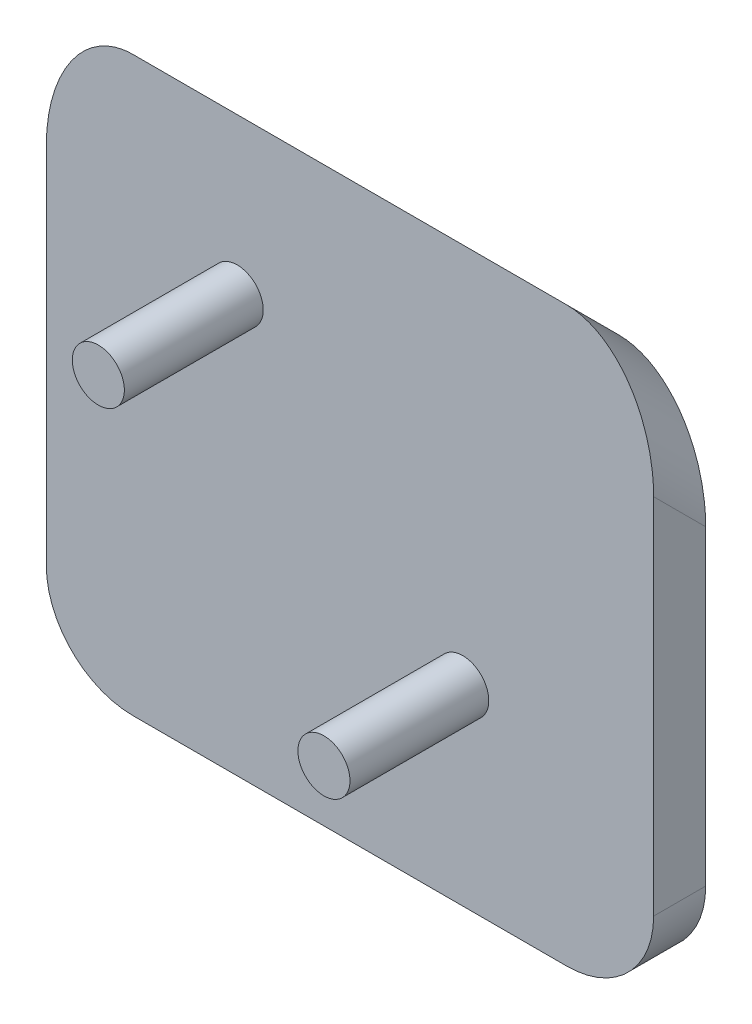
ISO-10303-21;
HEADER;
FILE_DESCRIPTION(('STEP AP214'),'2;1');
FILE_NAME('part.step','',(''),(''),'','','');
FILE_SCHEMA(('AUTOMOTIVE_DESIGN { 1 0 10303 214 1 1 1 1 }'));
ENDSEC;
DATA;
#1=APPLICATION_CONTEXT('core data for automotive mechanical design processes');
#2=APPLICATION_PROTOCOL_DEFINITION('international standard','automotive_design',2000,#1);
#3=PRODUCT_CONTEXT('',#1,'mechanical');
#4=PRODUCT('Part','Part','',(#3));
#5=PRODUCT_RELATED_PRODUCT_CATEGORY('part','',(#4));
#6=PRODUCT_DEFINITION_FORMATION('','',#4);
#7=PRODUCT_DEFINITION_CONTEXT('part definition',#1,'design');
#8=PRODUCT_DEFINITION('design','',#6,#7);
#9=PRODUCT_DEFINITION_SHAPE('','',#8);
#10=(LENGTH_UNIT() NAMED_UNIT(*) SI_UNIT(.MILLI.,.METRE.));
#11=(NAMED_UNIT(*) PLANE_ANGLE_UNIT() SI_UNIT($,.RADIAN.));
#12=(NAMED_UNIT(*) SI_UNIT($,.STERADIAN.) SOLID_ANGLE_UNIT());
#13=UNCERTAINTY_MEASURE_WITH_UNIT(LENGTH_MEASURE(1.E-05),#10,'distance_accuracy_value','');
#14=(GEOMETRIC_REPRESENTATION_CONTEXT(3) GLOBAL_UNCERTAINTY_ASSIGNED_CONTEXT((#13)) GLOBAL_UNIT_ASSIGNED_CONTEXT((#10,
#11,#12)) REPRESENTATION_CONTEXT('',''));
#15=CARTESIAN_POINT('',(0.,0.,0.));
#16=DIRECTION('',(0.,0.,1.));
#17=DIRECTION('',(1.,0.,0.));
#18=AXIS2_PLACEMENT_3D('',#15,#16,#17);
#19=CARTESIAN_POINT('',(0.,0.,3.));
#20=DIRECTION('',(1.,0.,0.));
#21=DIRECTION('',(0.,1.,0.));
#22=AXIS2_PLACEMENT_3D('',#19,#20,#21);
#23=PLANE('',#22);
#24=DIRECTION('',(0.,-1.,0.));
#25=VECTOR('',#24,1.);
#26=CARTESIAN_POINT('',(0.,0.,0.));
#27=LINE('',#26,#25);
#28=CARTESIAN_POINT('',(0.,22.9289321881345,0.));
#29=VERTEX_POINT('',#28);
#30=CARTESIAN_POINT('',(0.,5.,0.));
#31=VERTEX_POINT('',#30);
#32=EDGE_CURVE('E130',#29,#31,#27,.T.);
#33=ORIENTED_EDGE('',*,*,#32,.T.);
#34=DIRECTION('',(0.,0.,-1.));
#35=VECTOR('',#34,1.);
#36=CARTESIAN_POINT('',(0.,5.,3.));
#37=LINE('',#36,#35);
#38=CARTESIAN_POINT('',(0.,5.,3.));
#39=VERTEX_POINT('',#38);
#40=EDGE_CURVE('E108',#31,#39,#37,.F.);
#41=ORIENTED_EDGE('',*,*,#40,.T.);
#42=DIRECTION('',(0.,-1.,0.));
#43=VECTOR('',#42,1.);
#44=CARTESIAN_POINT('',(0.,0.,3.));
#45=LINE('',#44,#43);
#46=CARTESIAN_POINT('',(0.,25.9289321881345,3.));
#47=VERTEX_POINT('',#46);
#48=EDGE_CURVE('E133',#47,#39,#45,.T.);
#49=ORIENTED_EDGE('',*,*,#48,.F.);
#50=DIRECTION('',(0.,-0.707106781186544,-0.707106781186551));
#51=VECTOR('',#50,1.);
#52=CARTESIAN_POINT('',(0.,26.4644660940672,3.53553390593272));
#53=LINE('',#52,#51);
#54=EDGE_CURVE('E113',#47,#29,#53,.T.);
#55=ORIENTED_EDGE('',*,*,#54,.T.);
#56=EDGE_LOOP('',(#33,#41,#49,#55));
#57=FACE_BOUND('',#56,.T.);
#58=ADVANCED_FACE('F39',(#57),#23,.F.);
#59=CARTESIAN_POINT('',(0.,0.,3.));
#60=DIRECTION('',(0.,1.,0.));
#61=DIRECTION('',(0.,0.,1.));
#62=AXIS2_PLACEMENT_3D('',#59,#60,#61);
#63=PLANE('',#62);
#64=DIRECTION('',(1.,0.,0.));
#65=VECTOR('',#64,1.);
#66=CARTESIAN_POINT('',(0.,0.,3.));
#67=LINE('',#66,#65);
#68=CARTESIAN_POINT('',(5.,0.,3.));
#69=VERTEX_POINT('',#68);
#70=CARTESIAN_POINT('',(30.,0.,3.));
#71=VERTEX_POINT('',#70);
#72=EDGE_CURVE('E123',#69,#71,#67,.T.);
#73=ORIENTED_EDGE('',*,*,#72,.F.);
#74=DIRECTION('',(0.,0.,-1.));
#75=VECTOR('',#74,1.);
#76=CARTESIAN_POINT('',(5.,0.,3.));
#77=LINE('',#76,#75);
#78=CARTESIAN_POINT('',(5.,0.,0.));
#79=VERTEX_POINT('',#78);
#80=EDGE_CURVE('E107',#69,#79,#77,.T.);
#81=ORIENTED_EDGE('',*,*,#80,.T.);
#82=DIRECTION('',(1.,0.,0.));
#83=VECTOR('',#82,1.);
#84=CARTESIAN_POINT('',(0.,0.,0.));
#85=LINE('',#84,#83);
#86=CARTESIAN_POINT('',(30.,0.,0.));
#87=VERTEX_POINT('',#86);
#88=EDGE_CURVE('E120',#79,#87,#85,.T.);
#89=ORIENTED_EDGE('',*,*,#88,.T.);
#90=DIRECTION('',(0.,0.,-1.));
#91=VECTOR('',#90,1.);
#92=CARTESIAN_POINT('',(30.,0.,3.));
#93=LINE('',#92,#91);
#94=EDGE_CURVE('E125',#87,#71,#93,.F.);
#95=ORIENTED_EDGE('',*,*,#94,.T.);
#96=EDGE_LOOP('',(#73,#81,#89,#95));
#97=FACE_BOUND('',#96,.T.);
#98=ADVANCED_FACE('F119',(#97),#63,.F.);
#99=CARTESIAN_POINT('',(35.,0.,3.));
#100=DIRECTION('',(-1.,0.,0.));
#101=DIRECTION('',(0.,-1.,0.));
#102=AXIS2_PLACEMENT_3D('',#99,#100,#101);
#103=PLANE('',#102);
#104=DIRECTION('',(0.,1.,0.));
#105=VECTOR('',#104,1.);
#106=CARTESIAN_POINT('',(35.,0.,3.));
#107=LINE('',#106,#105);
#108=CARTESIAN_POINT('',(35.,5.,3.));
#109=VERTEX_POINT('',#108);
#110=CARTESIAN_POINT('',(35.,25.9289321881345,3.));
#111=VERTEX_POINT('',#110);
#112=EDGE_CURVE('E143',#109,#111,#107,.T.);
#113=ORIENTED_EDGE('',*,*,#112,.F.);
#114=DIRECTION('',(0.,0.,-1.));
#115=VECTOR('',#114,1.);
#116=CARTESIAN_POINT('',(35.,5.,3.));
#117=LINE('',#116,#115);
#118=CARTESIAN_POINT('',(35.,5.,0.));
#119=VERTEX_POINT('',#118);
#120=EDGE_CURVE('E169',#109,#119,#117,.T.);
#121=ORIENTED_EDGE('',*,*,#120,.T.);
#122=DIRECTION('',(0.,1.,0.));
#123=VECTOR('',#122,1.);
#124=CARTESIAN_POINT('',(35.,0.,0.));
#125=LINE('',#124,#123);
#126=CARTESIAN_POINT('',(35.,22.9289321881345,0.));
#127=VERTEX_POINT('',#126);
#128=EDGE_CURVE('E129',#119,#127,#125,.T.);
#129=ORIENTED_EDGE('',*,*,#128,.T.);
#130=DIRECTION('',(0.,0.707106781186544,0.707106781186551));
#131=VECTOR('',#130,1.);
#132=CARTESIAN_POINT('',(35.,29.4644660940672,6.53553390593272));
#133=LINE('',#132,#131);
#134=EDGE_CURVE('E166',#127,#111,#133,.T.);
#135=ORIENTED_EDGE('',*,*,#134,.T.);
#136=EDGE_LOOP('',(#113,#121,#129,#135));
#137=FACE_BOUND('',#136,.T.);
#138=ADVANCED_FACE('F174',(#137),#103,.F.);
#139=CARTESIAN_POINT('',(0.,0.,3.));
#140=DIRECTION('',(0.,0.,-1.));
#141=DIRECTION('',(-1.,0.,0.));
#142=AXIS2_PLACEMENT_3D('',#139,#140,#141);
#143=PLANE('',#142);
#144=CARTESIAN_POINT('',(24.,11.,3.));
#145=DIRECTION('',(0.,0.,-1.));
#146=DIRECTION('',(-1.,0.,0.));
#147=AXIS2_PLACEMENT_3D('',#144,#145,#146);
#148=CIRCLE('',#147,1.5);
#149=CARTESIAN_POINT('',(22.5,11.,3.));
#150=VERTEX_POINT('',#149);
#151=EDGE_CURVE('E142',#150,#150,#148,.F.);
#152=ORIENTED_EDGE('',*,*,#151,.F.);
#153=EDGE_LOOP('',(#152));
#154=FACE_BOUND('',#153,.T.);
#155=CARTESIAN_POINT('',(11.,24.,3.));
#156=DIRECTION('',(0.,0.,-1.));
#157=DIRECTION('',(-1.,0.,0.));
#158=AXIS2_PLACEMENT_3D('',#155,#156,#157);
#159=CIRCLE('',#158,1.5);
#160=CARTESIAN_POINT('',(9.49999999999998,24.,3.));
#161=VERTEX_POINT('',#160);
#162=EDGE_CURVE('E139',#161,#161,#159,.F.);
#163=ORIENTED_EDGE('',*,*,#162,.F.);
#164=EDGE_LOOP('',(#163));
#165=FACE_BOUND('',#164,.T.);
#166=ORIENTED_EDGE('',*,*,#48,.T.);
#167=CARTESIAN_POINT('',(5.,5.,3.));
#168=DIRECTION('',(0.,0.,-1.));
#169=DIRECTION('',(-1.,0.,0.));
#170=AXIS2_PLACEMENT_3D('',#167,#168,#169);
#171=CIRCLE('',#170,5.);
#172=EDGE_CURVE('E164',#39,#69,#171,.F.);
#173=ORIENTED_EDGE('',*,*,#172,.T.);
#174=ORIENTED_EDGE('',*,*,#72,.T.);
#175=CARTESIAN_POINT('',(30.,5.,3.));
#176=DIRECTION('',(0.,0.,-1.));
#177=DIRECTION('',(-1.,0.,0.));
#178=AXIS2_PLACEMENT_3D('',#175,#176,#177);
#179=CIRCLE('',#178,5.);
#180=EDGE_CURVE('E162',#71,#109,#179,.F.);
#181=ORIENTED_EDGE('',*,*,#180,.T.);
#182=ORIENTED_EDGE('',*,*,#112,.T.);
#183=CARTESIAN_POINT('',(30.,25.9289321881345,3.));
#184=DIRECTION('',(0.,0.,-1.));
#185=DIRECTION('',(0.,-1.,0.));
#186=AXIS2_PLACEMENT_3D('',#183,#184,#185);
#187=ELLIPSE('',#186,7.07106781186544,5.);
#188=CARTESIAN_POINT('',(30.,32.9999999999999,3.));
#189=VERTEX_POINT('',#188);
#190=EDGE_CURVE('E60',#111,#189,#187,.F.);
#191=ORIENTED_EDGE('',*,*,#190,.T.);
#192=DIRECTION('',(-1.,0.,0.));
#193=VECTOR('',#192,1.);
#194=CARTESIAN_POINT('',(0.,32.9999999999999,3.));
#195=LINE('',#194,#193);
#196=CARTESIAN_POINT('',(4.99999999999999,32.9999999999999,3.));
#197=VERTEX_POINT('',#196);
#198=EDGE_CURVE('E146',#189,#197,#195,.T.);
#199=ORIENTED_EDGE('',*,*,#198,.T.);
#200=CARTESIAN_POINT('',(4.99999999999999,25.9289321881345,3.));
#201=DIRECTION('',(0.,0.,-1.));
#202=DIRECTION('',(0.,1.,0.));
#203=AXIS2_PLACEMENT_3D('',#200,#201,#202);
#204=ELLIPSE('',#203,7.07106781186544,5.);
#205=EDGE_CURVE('E159',#197,#47,#204,.F.);
#206=ORIENTED_EDGE('',*,*,#205,.T.);
#207=EDGE_LOOP('',(#166,#173,#174,#181,#182,#191,#199,#206));
#208=FACE_BOUND('',#207,.T.);
#209=ADVANCED_FACE('F183',(#154,#165,#208),#143,.F.);
#210=CARTESIAN_POINT('',(0.,0.,0.));
#211=DIRECTION('',(0.,0.,-1.));
#212=DIRECTION('',(-1.,0.,0.));
#213=AXIS2_PLACEMENT_3D('',#210,#211,#212);
#214=PLANE('',#213);
#215=ORIENTED_EDGE('',*,*,#88,.F.);
#216=CARTESIAN_POINT('',(5.,5.,0.));
#217=DIRECTION('',(0.,0.,-1.));
#218=DIRECTION('',(-1.,0.,0.));
#219=AXIS2_PLACEMENT_3D('',#216,#217,#218);
#220=CIRCLE('',#219,5.);
#221=EDGE_CURVE('E103',#79,#31,#220,.T.);
#222=ORIENTED_EDGE('',*,*,#221,.T.);
#223=ORIENTED_EDGE('',*,*,#32,.F.);
#224=CARTESIAN_POINT('',(4.99999999999999,22.9289321881345,0.));
#225=DIRECTION('',(0.,0.,-1.));
#226=DIRECTION('',(0.,1.,0.));
#227=AXIS2_PLACEMENT_3D('',#224,#225,#226);
#228=ELLIPSE('',#227,7.07106781186544,5.);
#229=CARTESIAN_POINT('',(4.99999999999999,30.,0.));
#230=VERTEX_POINT('',#229);
#231=EDGE_CURVE('E124',#29,#230,#228,.T.);
#232=ORIENTED_EDGE('',*,*,#231,.T.);
#233=DIRECTION('',(1.,0.,0.));
#234=VECTOR('',#233,1.);
#235=CARTESIAN_POINT('',(35.,30.,0.));
#236=LINE('',#235,#234);
#237=CARTESIAN_POINT('',(30.,30.,0.));
#238=VERTEX_POINT('',#237);
#239=EDGE_CURVE('E148',#230,#238,#236,.T.);
#240=ORIENTED_EDGE('',*,*,#239,.T.);
#241=CARTESIAN_POINT('',(30.,22.9289321881345,0.));
#242=DIRECTION('',(0.,0.,-1.));
#243=DIRECTION('',(0.,-1.,0.));
#244=AXIS2_PLACEMENT_3D('',#241,#242,#243);
#245=ELLIPSE('',#244,7.07106781186544,5.);
#246=EDGE_CURVE('E153',#238,#127,#245,.T.);
#247=ORIENTED_EDGE('',*,*,#246,.T.);
#248=ORIENTED_EDGE('',*,*,#128,.F.);
#249=CARTESIAN_POINT('',(30.,5.,0.));
#250=DIRECTION('',(0.,0.,-1.));
#251=DIRECTION('',(-1.,0.,0.));
#252=AXIS2_PLACEMENT_3D('',#249,#250,#251);
#253=CIRCLE('',#252,5.);
#254=EDGE_CURVE('E114',#119,#87,#253,.T.);
#255=ORIENTED_EDGE('',*,*,#254,.T.);
#256=EDGE_LOOP('',(#215,#222,#223,#232,#240,#247,#248,#255));
#257=FACE_BOUND('',#256,.T.);
#258=ADVANCED_FACE('F127',(#257),#214,.T.);
#259=CARTESIAN_POINT('',(11.,24.,11.));
#260=DIRECTION('',(0.,0.,-1.));
#261=DIRECTION('',(-1.,0.,0.));
#262=AXIS2_PLACEMENT_3D('',#259,#260,#261);
#263=CYLINDRICAL_SURFACE('',#262,1.5);
#264=CARTESIAN_POINT('',(11.,24.,11.));
#265=DIRECTION('',(0.,0.,1.));
#266=DIRECTION('',(1.,0.,0.));
#267=AXIS2_PLACEMENT_3D('',#264,#265,#266);
#268=CIRCLE('',#267,1.5);
#269=CARTESIAN_POINT('',(12.5,24.,11.));
#270=VERTEX_POINT('',#269);
#271=EDGE_CURVE('E135',#270,#270,#268,.T.);
#272=ORIENTED_EDGE('',*,*,#271,.F.);
#273=EDGE_LOOP('',(#272));
#274=FACE_BOUND('',#273,.T.);
#275=ORIENTED_EDGE('',*,*,#162,.T.);
#276=EDGE_LOOP('',(#275));
#277=FACE_BOUND('',#276,.T.);
#278=ADVANCED_FACE('F207',(#274,#277),#263,.T.);
#279=CARTESIAN_POINT('',(11.,24.,11.));
#280=DIRECTION('',(0.,0.,1.));
#281=DIRECTION('',(1.,0.,0.));
#282=AXIS2_PLACEMENT_3D('',#279,#280,#281);
#283=PLANE('',#282);
#284=ORIENTED_EDGE('',*,*,#271,.T.);
#285=EDGE_LOOP('',(#284));
#286=FACE_BOUND('',#285,.T.);
#287=ADVANCED_FACE('F198',(#286),#283,.T.);
#288=CARTESIAN_POINT('',(24.,11.,11.));
#289=DIRECTION('',(0.,0.,-1.));
#290=DIRECTION('',(-1.,0.,0.));
#291=AXIS2_PLACEMENT_3D('',#288,#289,#290);
#292=CYLINDRICAL_SURFACE('',#291,1.5);
#293=CARTESIAN_POINT('',(24.,11.,11.));
#294=DIRECTION('',(0.,0.,1.));
#295=DIRECTION('',(1.,0.,0.));
#296=AXIS2_PLACEMENT_3D('',#293,#294,#295);
#297=CIRCLE('',#296,1.5);
#298=CARTESIAN_POINT('',(25.5,11.,11.));
#299=VERTEX_POINT('',#298);
#300=EDGE_CURVE('E189',#299,#299,#297,.T.);
#301=ORIENTED_EDGE('',*,*,#300,.F.);
#302=EDGE_LOOP('',(#301));
#303=FACE_BOUND('',#302,.T.);
#304=ORIENTED_EDGE('',*,*,#151,.T.);
#305=EDGE_LOOP('',(#304));
#306=FACE_BOUND('',#305,.T.);
#307=ADVANCED_FACE('F195',(#303,#306),#292,.T.);
#308=CARTESIAN_POINT('',(24.,11.,11.));
#309=DIRECTION('',(0.,0.,1.));
#310=DIRECTION('',(1.,0.,0.));
#311=AXIS2_PLACEMENT_3D('',#308,#309,#310);
#312=PLANE('',#311);
#313=ORIENTED_EDGE('',*,*,#300,.T.);
#314=EDGE_LOOP('',(#313));
#315=FACE_BOUND('',#314,.T.);
#316=ADVANCED_FACE('F193',(#315),#312,.T.);
#317=CARTESIAN_POINT('',(0.,35.,5.00000000000009));
#318=DIRECTION('',(0.,0.707106781186551,-0.707106781186544));
#319=DIRECTION('',(1.,0.,0.));
#320=AXIS2_PLACEMENT_3D('',#317,#318,#319);
#321=PLANE('',#320);
#322=ORIENTED_EDGE('',*,*,#198,.F.);
#323=DIRECTION('',(0.,0.707106781186544,0.707106781186551));
#324=VECTOR('',#323,1.);
#325=CARTESIAN_POINT('',(30.,30.,0.));
#326=LINE('',#325,#324);
#327=EDGE_CURVE('E11',#189,#238,#326,.F.);
#328=ORIENTED_EDGE('',*,*,#327,.T.);
#329=ORIENTED_EDGE('',*,*,#239,.F.);
#330=DIRECTION('',(0.,-0.707106781186544,-0.707106781186551));
#331=VECTOR('',#330,1.);
#332=CARTESIAN_POINT('',(4.99999999999999,32.9999999999999,3.));
#333=LINE('',#332,#331);
#334=EDGE_CURVE('E47',#230,#197,#333,.F.);
#335=ORIENTED_EDGE('',*,*,#334,.T.);
#336=EDGE_LOOP('',(#322,#328,#329,#335));
#337=FACE_BOUND('',#336,.T.);
#338=ADVANCED_FACE('F229',(#337),#321,.T.);
#339=CARTESIAN_POINT('',(5.,5.,3.));
#340=DIRECTION('',(0.,0.,-1.));
#341=DIRECTION('',(-1.,0.,0.));
#342=AXIS2_PLACEMENT_3D('',#339,#340,#341);
#343=CYLINDRICAL_SURFACE('',#342,5.);
#344=ORIENTED_EDGE('',*,*,#172,.F.);
#345=ORIENTED_EDGE('',*,*,#40,.F.);
#346=ORIENTED_EDGE('',*,*,#221,.F.);
#347=ORIENTED_EDGE('',*,*,#80,.F.);
#348=EDGE_LOOP('',(#344,#345,#346,#347));
#349=FACE_BOUND('',#348,.T.);
#350=ADVANCED_FACE('F106',(#349),#343,.T.);
#351=CARTESIAN_POINT('',(30.,5.,3.));
#352=DIRECTION('',(0.,0.,-1.));
#353=DIRECTION('',(-1.,0.,0.));
#354=AXIS2_PLACEMENT_3D('',#351,#352,#353);
#355=CYLINDRICAL_SURFACE('',#354,5.);
#356=ORIENTED_EDGE('',*,*,#180,.F.);
#357=ORIENTED_EDGE('',*,*,#94,.F.);
#358=ORIENTED_EDGE('',*,*,#254,.F.);
#359=ORIENTED_EDGE('',*,*,#120,.F.);
#360=EDGE_LOOP('',(#356,#357,#358,#359));
#361=FACE_BOUND('',#360,.T.);
#362=ADVANCED_FACE('F236',(#361),#355,.T.);
#363=CARTESIAN_POINT('',(30.,12.9644660940674,-9.96446609406725));
#364=DIRECTION('',(0.,-0.707106781186544,-0.707106781186551));
#365=DIRECTION('',(0.,0.707106781186551,-0.707106781186544));
#366=AXIS2_PLACEMENT_3D('',#363,#364,#365);
#367=CYLINDRICAL_SURFACE('',#366,5.);
#368=ORIENTED_EDGE('',*,*,#246,.F.);
#369=ORIENTED_EDGE('',*,*,#327,.F.);
#370=ORIENTED_EDGE('',*,*,#190,.F.);
#371=ORIENTED_EDGE('',*,*,#134,.F.);
#372=EDGE_LOOP('',(#368,#369,#370,#371));
#373=FACE_BOUND('',#372,.T.);
#374=ADVANCED_FACE('F181',(#373),#367,.T.);
#375=CARTESIAN_POINT('',(4.99999999999999,12.9644660940674,-9.96446609406725));
#376=DIRECTION('',(0.,0.707106781186544,0.707106781186551));
#377=DIRECTION('',(0.,-0.707106781186551,0.707106781186544));
#378=AXIS2_PLACEMENT_3D('',#375,#376,#377);
#379=CYLINDRICAL_SURFACE('',#378,5.);
#380=ORIENTED_EDGE('',*,*,#205,.F.);
#381=ORIENTED_EDGE('',*,*,#334,.F.);
#382=ORIENTED_EDGE('',*,*,#231,.F.);
#383=ORIENTED_EDGE('',*,*,#54,.F.);
#384=EDGE_LOOP('',(#380,#381,#382,#383));
#385=FACE_BOUND('',#384,.T.);
#386=ADVANCED_FACE('F41',(#385),#379,.T.);
#387=CLOSED_SHELL('',(#58,#98,#138,#209,#258,#278,#287,#307,#316,#338,#350,#362,#374,#386));
#388=MANIFOLD_SOLID_BREP('B2',#387);
#389=ADVANCED_BREP_SHAPE_REPRESENTATION('',(#18,#388),#14);
#390=SHAPE_DEFINITION_REPRESENTATION(#9,#389);
ENDSEC;
END-ISO-10303-21;
